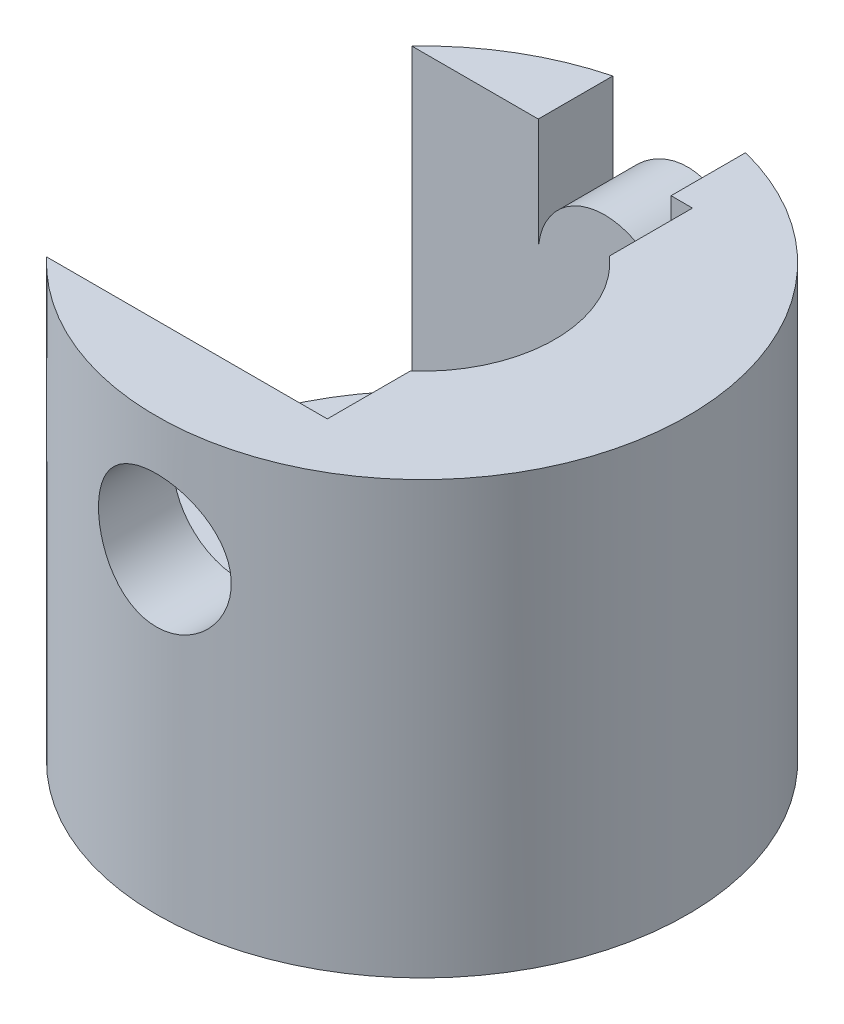
ISO-10303-21;
HEADER;
FILE_DESCRIPTION(('STEP AP214'),'2;1');
FILE_NAME('part.step','',(''),(''),'','','');
FILE_SCHEMA(('AUTOMOTIVE_DESIGN { 1 0 10303 214 1 1 1 1 }'));
ENDSEC;
DATA;
#1=APPLICATION_CONTEXT('core data for automotive mechanical design processes');
#2=APPLICATION_PROTOCOL_DEFINITION('international standard','automotive_design',2000,#1);
#3=PRODUCT_CONTEXT('',#1,'mechanical');
#4=PRODUCT('Part','Part','',(#3));
#5=PRODUCT_RELATED_PRODUCT_CATEGORY('part','',(#4));
#6=PRODUCT_DEFINITION_FORMATION('','',#4);
#7=PRODUCT_DEFINITION_CONTEXT('part definition',#1,'design');
#8=PRODUCT_DEFINITION('design','',#6,#7);
#9=PRODUCT_DEFINITION_SHAPE('','',#8);
#10=(LENGTH_UNIT() NAMED_UNIT(*) SI_UNIT(.MILLI.,.METRE.));
#11=(NAMED_UNIT(*) PLANE_ANGLE_UNIT() SI_UNIT($,.RADIAN.));
#12=(NAMED_UNIT(*) SI_UNIT($,.STERADIAN.) SOLID_ANGLE_UNIT());
#13=UNCERTAINTY_MEASURE_WITH_UNIT(LENGTH_MEASURE(1.E-05),#10,'distance_accuracy_value','');
#14=(GEOMETRIC_REPRESENTATION_CONTEXT(3) GLOBAL_UNCERTAINTY_ASSIGNED_CONTEXT((#13)) GLOBAL_UNIT_ASSIGNED_CONTEXT((#10,
#11,#12)) REPRESENTATION_CONTEXT('',''));
#15=CARTESIAN_POINT('',(0.,0.,0.));
#16=DIRECTION('',(0.,0.,1.));
#17=DIRECTION('',(1.,0.,0.));
#18=AXIS2_PLACEMENT_3D('',#15,#16,#17);
#19=CARTESIAN_POINT('',(0.,130.,0.));
#20=DIRECTION('',(0.,1.,0.));
#21=DIRECTION('',(0.,0.,1.));
#22=AXIS2_PLACEMENT_3D('',#19,#20,#21);
#23=PLANE('',#22);
#24=DIRECTION('',(0.,0.,1.));
#25=VECTOR('',#24,1.);
#26=CARTESIAN_POINT('',(-20.,130.,-55.));
#27=LINE('',#26,#25);
#28=CARTESIAN_POINT('',(-20.,130.,-77.4596669241483));
#29=VERTEX_POINT('',#28);
#30=CARTESIAN_POINT('',(-20.,130.,-55.));
#31=VERTEX_POINT('',#30);
#32=EDGE_CURVE('E122',#29,#31,#27,.T.);
#33=ORIENTED_EDGE('',*,*,#32,.F.);
#34=CARTESIAN_POINT('',(0.,130.,0.));
#35=DIRECTION('',(0.,1.,0.));
#36=DIRECTION('',(0.,0.,1.));
#37=AXIS2_PLACEMENT_3D('',#34,#35,#36);
#38=CIRCLE('',#37,80.);
#39=CARTESIAN_POINT('',(-58.0947501931112,130.,-55.));
#40=VERTEX_POINT('',#39);
#41=EDGE_CURVE('E47',#29,#40,#38,.T.);
#42=ORIENTED_EDGE('',*,*,#41,.T.);
#43=DIRECTION('',(1.,0.,0.));
#44=VECTOR('',#43,1.);
#45=CARTESIAN_POINT('',(-58.0947501931112,130.,-55.));
#46=LINE('',#45,#44);
#47=EDGE_CURVE('E176',#40,#31,#46,.T.);
#48=ORIENTED_EDGE('',*,*,#47,.T.);
#49=EDGE_LOOP('',(#33,#42,#48));
#50=FACE_BOUND('',#49,.T.);
#51=ADVANCED_FACE('F37',(#50),#23,.T.);
#52=CARTESIAN_POINT('',(0.,130.,0.));
#53=DIRECTION('',(0.,-1.,0.));
#54=DIRECTION('',(0.,0.,-1.));
#55=AXIS2_PLACEMENT_3D('',#52,#53,#54);
#56=CYLINDRICAL_SURFACE('',#55,80.);
#57=CARTESIAN_POINT('',(0.,0.,0.));
#58=DIRECTION('',(0.,1.,0.));
#59=DIRECTION('',(0.,0.,1.));
#60=AXIS2_PLACEMENT_3D('',#57,#58,#59);
#61=CIRCLE('',#60,80.);
#62=CARTESIAN_POINT('',(0.,0.,80.));
#63=VERTEX_POINT('',#62);
#64=EDGE_CURVE('E42',#63,#63,#61,.T.);
#65=ORIENTED_EDGE('',*,*,#64,.T.);
#66=EDGE_LOOP('',(#65));
#67=FACE_BOUND('',#66,.T.);
#68=ORIENTED_EDGE('',*,*,#41,.F.);
#69=DIRECTION('',(0.,1.,0.));
#70=VECTOR('',#69,1.);
#71=CARTESIAN_POINT('',(-20.,-0.001000000000001,-77.4596669241483));
#72=LINE('',#71,#70);
#73=CARTESIAN_POINT('',(-20.,95.,-77.4596669241483));
#74=VERTEX_POINT('',#73);
#75=EDGE_CURVE('E136',#74,#29,#72,.T.);
#76=ORIENTED_EDGE('',*,*,#75,.F.);
#77=CARTESIAN_POINT('',(20.,95.,-77.4596669241483));
#78=CARTESIAN_POINT('',(19.9999976493019,94.4477505366287,-77.45966837968));
#79=CARTESIAN_POINT('',(19.9771070159195,93.895454103291,-77.4655889217648));
#80=CARTESIAN_POINT('',(19.8857326315979,92.7948608282561,-77.4890948256312));
#81=CARTESIAN_POINT('',(19.8172436530298,92.2465644524332,-77.5066815248802));
#82=CARTESIAN_POINT('',(19.6352098850017,91.1576861665179,-77.5529970179961));
#83=CARTESIAN_POINT('',(19.5216416633879,90.6171084201946,-77.5817316063507));
#84=CARTESIAN_POINT('',(19.2504012466283,89.5478171732061,-77.6494788140806));
#85=CARTESIAN_POINT('',(19.092730156028,89.0191033757693,-77.6884911760501));
#86=CARTESIAN_POINT('',(18.7347858723762,87.9778573017547,-77.7755851607952));
#87=CARTESIAN_POINT('',(18.5345686633591,87.465304767494,-77.8236548562092));
#88=CARTESIAN_POINT('',(18.0929438772744,86.4590824887917,-77.9275099069875));
#89=CARTESIAN_POINT('',(17.8515360824935,85.9654128441728,-77.983295303133));
#90=CARTESIAN_POINT('',(17.3292908518329,85.0001600244818,-78.1010069709965));
#91=CARTESIAN_POINT('',(17.0484530849071,84.5285770348893,-78.1629332942712));
#92=CARTESIAN_POINT('',(16.4493016741369,83.6104891766527,-78.2912147047638));
#93=CARTESIAN_POINT('',(16.1309874837106,83.1639846739108,-78.3575698565685));
#94=CARTESIAN_POINT('',(15.4523295484327,82.2902579904637,-78.4942523513874));
#95=CARTESIAN_POINT('',(15.0912769316733,81.863594507003,-78.5646323973477));
#96=CARTESIAN_POINT('',(14.3348154256331,81.0420317489979,-78.7061693701151));
#97=CARTESIAN_POINT('',(13.9394061074495,80.6471328711154,-78.7773263066111));
#98=CARTESIAN_POINT('',(13.1167851377778,79.8916635671946,-78.9184647455924));
#99=CARTESIAN_POINT('',(12.6895706108638,79.531096251715,-78.9884461410974));
#100=CARTESIAN_POINT('',(11.8061470932551,78.8467625469031,-79.125309788489));
#101=CARTESIAN_POINT('',(11.3499379747291,78.5229963198368,-79.1921920267098));
#102=CARTESIAN_POINT('',(10.4049316417072,77.9102685280711,-79.3219262417081));
#103=CARTESIAN_POINT('',(9.91576778183844,77.6218573083554,-79.3847087368301));
#104=CARTESIAN_POINT('',(8.91402460740854,77.087366013059,-79.5034246104348));
#105=CARTESIAN_POINT('',(8.4014450082705,76.8412864521181,-79.5593579056472));
#106=CARTESIAN_POINT('',(7.35652241375885,76.3934247180437,-79.6627714076378));
#107=CARTESIAN_POINT('',(6.8241816790675,76.191637495995,-79.7102525777631));
#108=CARTESIAN_POINT('',(5.74352539274417,75.8339930035367,-79.7953985414387));
#109=CARTESIAN_POINT('',(5.19521021241926,75.6781346664991,-79.8330635629518));
#110=CARTESIAN_POINT('',(4.09790170386681,75.4163618174514,-79.8968278076243));
#111=CARTESIAN_POINT('',(3.54914710222575,75.3094995675713,-79.9231458592478));
#112=CARTESIAN_POINT('',(2.44420188812401,75.1420520699423,-79.9645640120267));
#113=CARTESIAN_POINT('',(1.88801136656687,75.081466256993,-79.9796642501915));
#114=CARTESIAN_POINT('',(0.772387784532631,75.0071033456653,-79.9982163345339));
#115=CARTESIAN_POINT('',(0.212955150704412,74.9933202223291,-80.0016696800274));
#116=CARTESIAN_POINT('',(-0.905043535883845,75.0126675549975,-79.9968334806817));
#117=CARTESIAN_POINT('',(-1.46360959931959,75.045797428389,-79.9885440816758));
#118=CARTESIAN_POINT('',(-2.56334384968023,75.1574213028508,-79.9607722552294));
#119=CARTESIAN_POINT('',(-3.10462280142206,75.2348907283915,-79.9415426857385));
#120=CARTESIAN_POINT('',(-4.17855638031179,75.433756625063,-79.892606672297));
#121=CARTESIAN_POINT('',(-4.71121115684745,75.5551523344515,-79.8629004100269));
#122=CARTESIAN_POINT('',(-5.76423944480283,75.8408979363048,-79.793809235484));
#123=CARTESIAN_POINT('',(-6.28461254980903,76.0052492480493,-79.7544240034146));
#124=CARTESIAN_POINT('',(-7.30956043959354,76.3756271479306,-79.6670251831232));
#125=CARTESIAN_POINT('',(-7.81413499970193,76.5816543284263,-79.6190114722615));
#126=CARTESIAN_POINT('',(-8.80864085397679,77.0358863395792,-79.5151562715121));
#127=CARTESIAN_POINT('',(-9.29839908441468,77.2844547353121,-79.4592481022651));
#128=CARTESIAN_POINT('',(-10.2552789976075,77.8206506027931,-79.3414246717065));
#129=CARTESIAN_POINT('',(-10.7224006070109,78.1082782010968,-79.2795093909314));
#130=CARTESIAN_POINT('',(-11.6311098742688,78.7206414852758,-79.1512974913243));
#131=CARTESIAN_POINT('',(-12.0726938117613,79.045382557485,-79.0850002371202));
#132=CARTESIAN_POINT('',(-12.9274947222486,79.7297783994631,-78.9497762308026));
#133=CARTESIAN_POINT('',(-13.3407111650586,80.0894338214734,-78.8808494295807));
#134=CARTESIAN_POINT('',(-14.1469748210318,80.8515342222075,-78.7403015629414));
#135=CARTESIAN_POINT('',(-14.5391724570307,81.2548744010124,-78.6686580917767));
#136=CARTESIAN_POINT('',(-15.2883058227192,82.0932675123287,-78.5265121249807));
#137=CARTESIAN_POINT('',(-15.6452408930943,82.5283210375297,-78.4560096507035));
#138=CARTESIAN_POINT('',(-16.3214268715421,83.4273001593975,-78.3181341115604));
#139=CARTESIAN_POINT('',(-16.6406757432225,83.8912273141982,-78.2507612159222));
#140=CARTESIAN_POINT('',(-17.239202615518,84.8448632993083,-78.1210835720695));
#141=CARTESIAN_POINT('',(-17.5184808015765,85.33457200999,-78.0587788003422));
#142=CARTESIAN_POINT('',(-18.0362602046587,86.3389335232051,-77.9407737441754));
#143=CARTESIAN_POINT('',(-18.2745555859852,86.8536964803494,-77.8851072054245));
#144=CARTESIAN_POINT('',(-18.7068193138944,87.9023568353277,-77.7824164163084));
#145=CARTESIAN_POINT('',(-18.9007873799356,88.4362543542369,-77.7353922206398));
#146=CARTESIAN_POINT('',(-19.2427595818706,89.5192520829459,-77.6514470713696));
#147=CARTESIAN_POINT('',(-19.3907717788096,90.068349608112,-77.6145243460204));
#148=CARTESIAN_POINT('',(-19.6395945432371,91.1777652676668,-77.551936285079));
#149=CARTESIAN_POINT('',(-19.7404063560237,91.7380831056208,-77.5262706524897));
#150=CARTESIAN_POINT('',(-19.8919014124738,92.8507796547977,-77.4875357832161));
#151=CARTESIAN_POINT('',(-19.9438388755152,93.4029769143795,-77.474151616895));
#152=CARTESIAN_POINT('',(-20.001674731883,94.5099335710854,-77.4592403380146));
#153=CARTESIAN_POINT('',(-20.0075739323212,95.0646929231221,-77.4577130175892));
#154=CARTESIAN_POINT('',(-19.973284082299,96.1726398598568,-77.4665620086827));
#155=CARTESIAN_POINT('',(-19.9330989462917,96.7258275740506,-77.4769373091803));
#156=CARTESIAN_POINT('',(-19.8069970278536,97.8266192368147,-77.5092710191194));
#157=CARTESIAN_POINT('',(-19.7210804467414,98.3742232099549,-77.5312293775702));
#158=CARTESIAN_POINT('',(-19.506032407673,99.4509732061142,-77.5856092367837));
#159=CARTESIAN_POINT('',(-19.377632844242,99.980274656623,-77.6178532209274));
#160=CARTESIAN_POINT('',(-19.0783358937308,101.026017563014,-77.691961241754));
#161=CARTESIAN_POINT('',(-18.9074390990744,101.542459198056,-77.7338251443318));
#162=CARTESIAN_POINT('',(-18.5244464116937,102.559099124078,-77.8259831195735));
#163=CARTESIAN_POINT('',(-18.31234684904,103.059295963499,-77.8762779431245));
#164=CARTESIAN_POINT('',(-17.8485161428307,104.040177352478,-77.9838901168577));
#165=CARTESIAN_POINT('',(-17.596784199686,104.520861508119,-78.041207608718));
#166=CARTESIAN_POINT('',(-17.050140557841,105.468903813968,-78.1624755524835));
#167=CARTESIAN_POINT('',(-16.7544788355005,105.935815722887,-78.2265340447418));
#168=CARTESIAN_POINT('',(-16.1258425389138,106.843219952829,-78.3585369751919));
#169=CARTESIAN_POINT('',(-15.7928675666899,107.283711991984,-78.4264814548272));
#170=CARTESIAN_POINT('',(-15.0917774222407,108.135546532086,-78.5644058735959));
#171=CARTESIAN_POINT('',(-14.7236572252104,108.546884850157,-78.6343861027884));
#172=CARTESIAN_POINT('',(-13.9547000125146,109.337731448901,-78.774482218363));
#173=CARTESIAN_POINT('',(-13.5538625368302,109.717239281873,-78.8445981066391));
#174=CARTESIAN_POINT('',(-12.7115903273172,110.451058251851,-78.9848227719709));
#175=CARTESIAN_POINT('',(-12.2693900151829,110.804499760193,-79.0548873483663));
#176=CARTESIAN_POINT('',(-11.3562317557386,111.472891645209,-79.1912184360659));
#177=CARTESIAN_POINT('',(-10.885273274809,111.787841307324,-79.2574848768499));
#178=CARTESIAN_POINT('',(-9.9177839385446,112.376947739056,-79.3843532707781));
#179=CARTESIAN_POINT('',(-9.42125387584849,112.651105772061,-79.4449553993345));
#180=CARTESIAN_POINT('',(-8.40601947649277,113.15655157691,-79.5587814272681));
#181=CARTESIAN_POINT('',(-7.88731546792381,113.387839982792,-79.6120054357643));
#182=CARTESIAN_POINT('',(-6.83524933911152,113.804176671815,-79.7091987430276));
#183=CARTESIAN_POINT('',(-6.30202229774122,113.989551016729,-79.7532329298633));
#184=CARTESIAN_POINT('',(-5.22112203239086,114.31471956433,-79.8312811833417));
#185=CARTESIAN_POINT('',(-4.67344883812773,114.454513860771,-79.8652952705948));
#186=CARTESIAN_POINT('',(-3.56776949188514,114.687309301311,-79.9223210224658));
#187=CARTESIAN_POINT('',(-3.00976501703529,114.780317972492,-79.9453344568885));
#188=CARTESIAN_POINT('',(-1.88753231503774,114.918756057542,-79.9796994772742));
#189=CARTESIAN_POINT('',(-1.32330422461221,114.964186514528,-79.9910513189087));
#190=CARTESIAN_POINT('',(-0.208225808915083,115.006485847005,-80.0016192868872));
#191=CARTESIAN_POINT('',(0.342573298231126,115.00463571553,-80.0011555390562));
#192=CARTESIAN_POINT('',(1.44200943374339,114.955535260996,-79.9888918528778));
#193=CARTESIAN_POINT('',(1.9906465035497,114.908285812408,-79.9770921328811));
#194=CARTESIAN_POINT('',(3.08179336996437,114.768790109732,-79.9424825094208));
#195=CARTESIAN_POINT('',(3.62430337979254,114.676545426431,-79.9196729903105));
#196=CARTESIAN_POINT('',(4.69936887164887,114.447826520613,-79.8636693212432));
#197=CARTESIAN_POINT('',(5.23192430907164,114.311352099956,-79.8304751247652));
#198=CARTESIAN_POINT('',(6.28052796768513,113.996133477857,-79.7548106955068));
#199=CARTESIAN_POINT('',(6.79664995828471,113.817622163078,-79.7123916644837));
#200=CARTESIAN_POINT('',(7.81192754964574,113.419314649645,-79.619304689993));
#201=CARTESIAN_POINT('',(8.31108326347316,113.199518726183,-79.5686368015101));
#202=CARTESIAN_POINT('',(9.28923103353537,112.720238186338,-79.4603823645421));
#203=CARTESIAN_POINT('',(9.76822116063031,112.460749783729,-79.4027951561423));
#204=CARTESIAN_POINT('',(10.7029568700637,111.903924957003,-79.2822100272022));
#205=CARTESIAN_POINT('',(11.1587019902907,111.606587780862,-79.2192119991613));
#206=CARTESIAN_POINT('',(12.0547258916069,110.968509075814,-79.0878847524053));
#207=CARTESIAN_POINT('',(12.4943723559947,110.626898189759,-79.0194639576567));
#208=CARTESIAN_POINT('',(13.3434844344005,109.908411805057,-78.8805207050474));
#209=CARTESIAN_POINT('',(13.7529495439741,109.531535717234,-78.8099982120872));
#210=CARTESIAN_POINT('',(14.5391474997276,108.74490756844,-78.6687535130242));
#211=CARTESIAN_POINT('',(14.915872313816,108.335147487281,-78.5980312622845));
#212=CARTESIAN_POINT('',(15.634002794518,107.485486332693,-78.4583443831096));
#213=CARTESIAN_POINT('',(15.975408450149,107.045585249892,-78.389379755221));
#214=CARTESIAN_POINT('',(16.6266285422317,106.129990073696,-78.253868498207));
#215=CARTESIAN_POINT('',(16.9357336359601,105.653780828662,-78.1873911118747));
#216=CARTESIAN_POINT('',(17.5126576837246,104.676205287554,-78.0601955430651));
#217=CARTESIAN_POINT('',(17.7804746699988,104.174837793966,-77.9994776351337));
#218=CARTESIAN_POINT('',(18.2725948716073,103.150755319888,-77.8856601317807));
#219=CARTESIAN_POINT('',(18.4969262265036,102.628054411175,-77.8325556155651));
#220=CARTESIAN_POINT('',(18.9004633820715,101.564734268076,-77.735549246793));
#221=CARTESIAN_POINT('',(19.0796760623687,101.024117779675,-77.6916459914138));
#222=CARTESIAN_POINT('',(19.3619707467141,100.032616036064,-77.6217170916352));
#223=CARTESIAN_POINT('',(19.4730420315856,99.584113751948,-77.5938805058715));
#224=CARTESIAN_POINT('',(19.663958698367,98.6799756629647,-77.5457184812528));
#225=CARTESIAN_POINT('',(19.7437964187594,98.2243381363107,-77.5253948853833));
#226=CARTESIAN_POINT('',(19.8717193776867,97.3083744156483,-77.4927037623413));
#227=CARTESIAN_POINT('',(19.9198067892231,96.8480485447019,-77.4803356906916));
#228=CARTESIAN_POINT('',(19.9839439088543,95.9251590250346,-77.4638177332034));
#229=CARTESIAN_POINT('',(20.0000019690803,95.4625959912337,-77.4596657049111));
#230=CARTESIAN_POINT('',(20.,95.,-77.4596669241483));
#231=B_SPLINE_CURVE_WITH_KNOTS('',3,(#77,#78,#79,#80,#81,#82,#83,#84,#85,#86,#87,#88,#89,#90,
#91,#92,#93,#94,#95,#96,#97,#98,#99,#100,#101,#102,#103,#104,#105,#106,#107,#108,#109,#110,#111,
#112,#113,#114,#115,#116,#117,#118,#119,#120,#121,#122,#123,#124,#125,#126,#127,#128,#129,#130,
#131,#132,#133,#134,#135,#136,#137,#138,#139,#140,#141,#142,#143,#144,#145,#146,#147,#148,#149,
#150,#151,#152,#153,#154,#155,#156,#157,#158,#159,#160,#161,#162,#163,#164,#165,#166,#167,#168,
#169,#170,#171,#172,#173,#174,#175,#176,#177,#178,#179,#180,#181,#182,#183,#184,#185,#186,#187,
#188,#189,#190,#191,#192,#193,#194,#195,#196,#197,#198,#199,#200,#201,#202,#203,#204,#205,#206,
#207,#208,#209,#210,#211,#212,#213,#214,#215,#216,#217,#218,#219,#220,#221,#222,#223,#224,#225,
#226,#227,#228,#229,#230),.UNSPECIFIED.,.T.,.F.,(4,2,2,2,2,2,2,2,2,2,2,2,2,2,2,2,2,2,2,2,2,2,2,
2,2,2,2,2,2,2,2,2,2,2,2,2,2,2,2,2,2,2,2,2,2,2,2,2,2,2,2,2,2,2,2,2,2,2,2,2,2,2,2,2,2,2,2,2,2,2,2,
2,2,2,2,2,4),(0.,1.65632565075379,3.31284122390797,4.97021898245634,6.62755523610075,
8.28272405107371,9.93790161473371,11.5930930757675,13.2483086802409,14.9363807765496,
16.6244739494697,18.3127199242449,20.0009733426711,21.7128477433761,23.4247429544272,
25.1364429238655,26.8481031385591,28.5250909718271,30.2020583227634,31.8788097878022,
33.5555404294267,35.1950059734611,36.8344430882628,38.4739343779278,40.113448972096,
41.7677470910819,43.422050570278,45.0765944466321,46.7311692377786,48.430564374821,
50.1299912799474,51.8295099724496,53.5290207798018,55.236832749169,56.944655526746,
58.652178568412,60.3596565575824,62.0220157033976,63.6843457057922,65.3465345185485,
67.0087160140934,68.6436354791722,70.2785321542713,71.9135745163924,73.5486498699601,
75.2157926192829,76.8829531518001,78.5503524006036,80.2177750977823,81.9269783989499,
83.6362134247319,85.3453955014516,87.0545522974806,88.751198980581,90.4478421738118,
92.1442123161098,93.8405452659871,95.4909687201875,97.1413603849702,98.7916944385566,
100.442035885342,102.083440957036,103.724835088,105.366385887691,107.007969308756,
108.688889835239,110.369838449879,112.051198289983,113.732558652915,115.445330157796,
117.158183266933,118.869924261035,120.581404093229,121.9689547397,123.356845535881,
124.744641334518,126.132075197357),.UNSPECIFIED.);
#232=CARTESIAN_POINT('',(20.,95.,-77.4596669241483));
#233=VERTEX_POINT('',#232);
#234=EDGE_CURVE('E135',#74,#233,#231,.T.);
#235=ORIENTED_EDGE('',*,*,#234,.T.);
#236=DIRECTION('',(0.,1.,0.));
#237=VECTOR('',#236,1.);
#238=CARTESIAN_POINT('',(20.,-0.001000000000001,-77.4596669241483));
#239=LINE('',#238,#237);
#240=CARTESIAN_POINT('',(20.,130.,-77.4596669241483));
#241=VERTEX_POINT('',#240);
#242=EDGE_CURVE('E54',#233,#241,#239,.T.);
#243=ORIENTED_EDGE('',*,*,#242,.T.);
#244=CARTESIAN_POINT('',(-58.0947501931112,130.,55.));
#245=VERTEX_POINT('',#244);
#246=EDGE_CURVE('E11',#245,#241,#38,.T.);
#247=ORIENTED_EDGE('',*,*,#246,.F.);
#248=DIRECTION('',(0.,-1.,0.));
#249=VECTOR('',#248,1.);
#250=CARTESIAN_POINT('',(-58.0947501931112,130.,55.));
#251=LINE('',#250,#249);
#252=CARTESIAN_POINT('',(-58.0947501931112,40.,55.));
#253=VERTEX_POINT('',#252);
#254=EDGE_CURVE('E204',#245,#253,#251,.T.);
#255=ORIENTED_EDGE('',*,*,#254,.T.);
#256=CARTESIAN_POINT('',(0.,40.,0.));
#257=DIRECTION('',(0.,-1.,0.));
#258=DIRECTION('',(0.,0.,1.));
#259=AXIS2_PLACEMENT_3D('',#256,#257,#258);
#260=CIRCLE('',#259,80.);
#261=CARTESIAN_POINT('',(-58.0947501931112,40.,-55.));
#262=VERTEX_POINT('',#261);
#263=EDGE_CURVE('E173',#253,#262,#260,.T.);
#264=ORIENTED_EDGE('',*,*,#263,.T.);
#265=DIRECTION('',(0.,-1.,0.));
#266=VECTOR('',#265,1.);
#267=CARTESIAN_POINT('',(-58.0947501931112,130.,-55.));
#268=LINE('',#267,#266);
#269=EDGE_CURVE('E191',#40,#262,#268,.T.);
#270=ORIENTED_EDGE('',*,*,#269,.F.);
#271=EDGE_LOOP('',(#68,#76,#235,#243,#247,#255,#264,#270));
#272=FACE_BOUND('',#271,.T.);
#273=CARTESIAN_POINT('',(0.,75.,80.));
#274=CARTESIAN_POINT('',(0.552553374862314,75.0000023314968,79.9999986950356));
#275=CARTESIAN_POINT('',(1.10515356950526,75.0229179658283,79.9942610849838));
#276=CARTESIAN_POINT('',(2.20636296648807,75.114394489958,79.9714660513514));
#277=CARTESIAN_POINT('',(2.75497170625673,75.1829605876346,79.9544073362416));
#278=CARTESIAN_POINT('',(3.84448035075908,75.3652050745676,79.9094323300751));
#279=CARTESIAN_POINT('',(4.38537620054034,75.4789063483961,79.8815105313286));
#280=CARTESIAN_POINT('',(5.45531134581282,75.7504750259673,79.8155804522386));
#281=CARTESIAN_POINT('',(5.98435094400592,75.908341300743,79.7775724297252));
#282=CARTESIAN_POINT('',(7.02629056749776,76.266756744417,79.692560221474));
#283=CARTESIAN_POINT('',(7.53920942950872,76.467253797031,79.6455670271467));
#284=CARTESIAN_POINT('',(8.54613454441612,76.9095061873634,79.5438224095931));
#285=CARTESIAN_POINT('',(9.04014069713948,77.1512617435747,79.4890709452816));
#286=CARTESIAN_POINT('',(10.006009638304,77.6742566340583,79.3732724764846));
#287=CARTESIAN_POINT('',(10.4778724123847,77.9554959939362,79.3122254679164));
#288=CARTESIAN_POINT('',(11.3964465566084,78.5554883495366,79.1854532836813));
#289=CARTESIAN_POINT('',(11.8431575789993,78.8742418637475,79.1197280433608));
#290=CARTESIAN_POINT('',(12.7166269502415,79.5533479268748,78.9840892744047));
#291=CARTESIAN_POINT('',(13.1428634930067,79.914360796854,78.9141207667824));
#292=CARTESIAN_POINT('',(13.9635663670633,80.6706522026163,78.7730425035487));
#293=CARTESIAN_POINT('',(14.358032322819,81.0659311433175,78.7019327344592));
#294=CARTESIAN_POINT('',(15.1126515394363,81.8882042431445,78.5605192145215));
#295=CARTESIAN_POINT('',(15.4728010871473,82.3152018254582,78.490215551619));
#296=CARTESIAN_POINT('',(16.1563281947099,83.1981042190157,78.3523749041428));
#297=CARTESIAN_POINT('',(16.4797055460334,83.654009194165,78.2848379352598));
#298=CARTESIAN_POINT('',(17.0919754850718,84.5987541640258,78.1534638181262));
#299=CARTESIAN_POINT('',(17.3802827011821,85.0879835678767,78.0896967594462));
#300=CARTESIAN_POINT('',(17.9145598711437,86.0898463182741,77.9688630436013));
#301=CARTESIAN_POINT('',(18.1605292905372,86.6024799601642,77.9117964710237));
#302=CARTESIAN_POINT('',(18.6081694440892,87.6475107265207,77.806098433039));
#303=CARTESIAN_POINT('',(18.8098456887771,88.1799053828671,77.7574659185063));
#304=CARTESIAN_POINT('',(19.167269734681,89.2606876202089,77.6701336387272));
#305=CARTESIAN_POINT('',(19.3230186360386,89.8090748177737,77.6314336355609));
#306=CARTESIAN_POINT('',(19.5846005492968,90.9066751128424,77.5658510578936));
#307=CARTESIAN_POINT('',(19.6913708451233,91.4556516774823,77.5387473172898));
#308=CARTESIAN_POINT('',(19.8586008155615,92.5610597920003,77.4960866447944));
#309=CARTESIAN_POINT('',(19.9190610516028,93.1174912514175,77.4805295729194));
#310=CARTESIAN_POINT('',(19.9931329860711,94.233590647834,77.4614491387815));
#311=CARTESIAN_POINT('',(20.0067513360911,94.7932581140105,77.4579240679634));
#312=CARTESIAN_POINT('',(19.9870360082187,95.9117056144315,77.4630137483269));
#313=CARTESIAN_POINT('',(19.9537029831812,96.4704856609073,77.4716283307076));
#314=CARTESIAN_POINT('',(19.841761814828,97.569460466295,77.5003723188602));
#315=CARTESIAN_POINT('',(19.7642724534682,98.1097770919092,77.5202171040157));
#316=CARTESIAN_POINT('',(19.5655280775596,99.1817789964538,77.570616893999));
#317=CARTESIAN_POINT('',(19.4442738771995,99.7134644357641,77.6011716995804));
#318=CARTESIAN_POINT('',(19.1589731789207,100.764575301028,77.6721013280764));
#319=CARTESIAN_POINT('',(18.994924592257,101.284000127205,77.7124766303118));
#320=CARTESIAN_POINT('',(18.6253121998604,102.307091944643,77.8018885701763));
#321=CARTESIAN_POINT('',(18.4197477402838,102.810758687582,77.8509253442155));
#322=CARTESIAN_POINT('',(17.9663570726194,103.804036121401,77.9568131713948));
#323=CARTESIAN_POINT('',(17.718125928368,104.293454063028,78.0137379785739));
#324=CARTESIAN_POINT('',(17.1826589445638,105.249708814394,78.133420866079));
#325=CARTESIAN_POINT('',(16.8954229609801,105.71654554074,78.1961789679449));
#326=CARTESIAN_POINT('',(16.2838786113378,106.624760311453,78.3258129296076));
#327=CARTESIAN_POINT('',(15.9595648266115,107.066134620445,78.3926893906138));
#328=CARTESIAN_POINT('',(15.2760389627995,107.92060297996,78.5287465444139));
#329=CARTESIAN_POINT('',(14.9168262158307,108.333696488999,78.5979272812894));
#330=CARTESIAN_POINT('',(14.1550737678961,109.140379914247,78.738733251184));
#331=CARTESIAN_POINT('',(13.7515900632081,109.533076639801,78.8103718974193));
#332=CARTESIAN_POINT('',(12.9128067481253,110.283193125012,78.9521393106884));
#333=CARTESIAN_POINT('',(12.4775065163574,110.640612195381,79.0222680481992));
#334=CARTESIAN_POINT('',(11.5779456993448,111.317723473108,79.1590684580988));
#335=CARTESIAN_POINT('',(11.113683981535,111.63741420365,79.2257399951037));
#336=CARTESIAN_POINT('',(10.1593031083248,112.236765052455,79.3537669415628));
#337=CARTESIAN_POINT('',(9.66918411063258,112.516425414831,79.4151223834348));
#338=CARTESIAN_POINT('',(8.66465976090819,113.034526367728,79.5310011038941));
#339=CARTESIAN_POINT('',(8.15017608224034,113.272820652387,79.5854999519251));
#340=CARTESIAN_POINT('',(7.10209907529817,113.705120103132,79.685866283564));
#341=CARTESIAN_POINT('',(6.56850563968339,113.899125020399,79.7317337186796));
#342=CARTESIAN_POINT('',(5.48613684717225,114.241215755903,79.8135125120124));
#343=CARTESIAN_POINT('',(4.93736386767441,114.389308720946,79.8494254196919));
#344=CARTESIAN_POINT('',(3.82862493749695,114.638340968327,79.9102611106421));
#345=CARTESIAN_POINT('',(3.26865926312345,114.739281413191,79.9351841648622));
#346=CARTESIAN_POINT('',(2.15620947798921,114.89114894507,79.9728237841376));
#347=CARTESIAN_POINT('',(1.6039008987919,114.943290392048,79.9858365432587));
#348=CARTESIAN_POINT('',(0.496713964469053,115.001514241305,80.0003735412268));
#349=CARTESIAN_POINT('',(-0.0581643466547616,115.007597429346,80.0018979760668));
#350=CARTESIAN_POINT('',(-1.16637153729242,114.973654575439,79.9934160549155));
#351=CARTESIAN_POINT('',(-1.71970054145991,114.933632356509,79.9834106549674));
#352=CARTESIAN_POINT('',(-2.82080714740937,114.807829492892,79.9521507125016));
#353=CARTESIAN_POINT('',(-3.36858477088819,114.722049027115,79.9308962139667));
#354=CARTESIAN_POINT('',(-4.44655600282126,114.507068243944,79.8781261803535));
#355=CARTESIAN_POINT('',(-4.97688994266787,114.378531840119,79.8467677590568));
#356=CARTESIAN_POINT('',(-6.0246819666538,114.078787561056,79.7745510411713));
#357=CARTESIAN_POINT('',(-6.5421402169409,113.907580236758,79.7336928672376));
#358=CARTESIAN_POINT('',(-7.56075993095561,113.523799746173,79.6435583563946));
#359=CARTESIAN_POINT('',(-8.06192019042454,113.311223531208,79.594281399096));
#360=CARTESIAN_POINT('',(-9.0446492667819,112.846283039438,79.488606685726));
#361=CARTESIAN_POINT('',(-9.52621772176592,112.593918028065,79.4322087981941));
#362=CARTESIAN_POINT('',(-10.4750517301961,112.046366511104,79.3127101495236));
#363=CARTESIAN_POINT('',(-10.9419120576077,111.750499838884,79.2495082373428));
#364=CARTESIAN_POINT('',(-11.8491713422069,111.121471770117,79.1189435371977));
#365=CARTESIAN_POINT('',(-12.2895700424967,110.788310011588,79.0515807088509));
#366=CARTESIAN_POINT('',(-13.1411743549394,110.086878075293,78.9144828604604));
#367=CARTESIAN_POINT('',(-13.5523755645437,109.718602622434,78.8447474850069));
#368=CARTESIAN_POINT('',(-14.3429051286227,108.949381524516,78.7047790615734));
#369=CARTESIAN_POINT('',(-14.7222330212665,108.54843540624,78.6345460063983));
#370=CARTESIAN_POINT('',(-15.4554827101946,107.706195733532,78.4937632096491));
#371=CARTESIAN_POINT('',(-15.8085508811845,107.264152698877,78.4232481144074));
#372=CARTESIAN_POINT('',(-16.4762179413208,106.3513867207,78.2856977121869));
#373=CARTESIAN_POINT('',(-16.7908161284427,105.880663254034,78.2186624687235));
#374=CARTESIAN_POINT('',(-17.3792647928895,104.913700641748,78.0900243334746));
#375=CARTESIAN_POINT('',(-17.6531162246028,104.41746209412,78.028421314467));
#376=CARTESIAN_POINT('',(-18.1580075024502,103.40284703356,77.9124758787017));
#377=CARTESIAN_POINT('',(-18.38904794416,102.884470828726,77.8581333609407));
#378=CARTESIAN_POINT('',(-18.8052327904798,101.832373000456,77.7586571272349));
#379=CARTESIAN_POINT('',(-18.9906442492249,101.298762108759,77.7134701157289));
#380=CARTESIAN_POINT('',(-19.3158302466352,100.217053611288,77.6332839916808));
#381=CARTESIAN_POINT('',(-19.45560484926,99.6689560258191,77.5982848648605));
#382=CARTESIAN_POINT('',(-19.6882921199968,98.5624065632102,77.5395742477722));
#383=CARTESIAN_POINT('',(-19.7812133869948,98.0039566055372,77.5158606863349));
#384=CARTESIAN_POINT('',(-19.9194035268512,96.8808173565845,77.4804651303761));
#385=CARTESIAN_POINT('',(-19.9646735461771,96.3161282157472,77.4687828463876));
#386=CARTESIAN_POINT('',(-20.006544440919,95.2011049015523,77.4579796397084));
#387=CARTESIAN_POINT('',(-20.0045072413989,94.6508248153061,77.458507206743));
#388=CARTESIAN_POINT('',(-19.955119444869,93.5524461860496,77.471245375213));
#389=CARTESIAN_POINT('',(-19.9077697647612,93.0043475991218,77.4834557402459));
#390=CARTESIAN_POINT('',(-19.7681649668449,91.9142940024709,77.5191900538641));
#391=CARTESIAN_POINT('',(-19.6759110430741,91.3723388297819,77.5427137016204));
#392=CARTESIAN_POINT('',(-19.447271019217,90.2983979782611,77.6003706603106));
#393=CARTESIAN_POINT('',(-19.3108846978968,89.7664123494204,77.6345040244305));
#394=CARTESIAN_POINT('',(-18.9960334265046,88.7192472678552,77.7121406936939));
#395=CARTESIAN_POINT('',(-18.8178253218216,88.203986257501,77.7555866703632));
#396=CARTESIAN_POINT('',(-18.4202695685337,87.1903884927253,77.8507251840838));
#397=CARTESIAN_POINT('',(-18.2009222146742,86.6920516170796,77.9024176620519));
#398=CARTESIAN_POINT('',(-17.7226695392884,85.7154626148664,78.0126090527825));
#399=CARTESIAN_POINT('',(-17.4637600006768,85.237212636375,78.0711086909877));
#400=CARTESIAN_POINT('',(-16.9082059346409,84.3038539177666,78.193308108687));
#401=CARTESIAN_POINT('',(-16.6115606027014,83.8487456713136,78.2570079990384));
#402=CARTESIAN_POINT('',(-15.9743007405763,82.9529388612967,78.3896061005777));
#403=CARTESIAN_POINT('',(-15.6327408347731,82.5129262235746,78.4585965855524));
#404=CARTESIAN_POINT('',(-14.9142797308121,81.6630629615619,78.5983342852843));
#405=CARTESIAN_POINT('',(-14.5373779019106,81.2532128758123,78.6690815313776));
#406=CARTESIAN_POINT('',(-13.7506188212402,80.4662418429339,78.8104067881818));
#407=CARTESIAN_POINT('',(-13.3407540056256,80.0891284492414,78.8809847562011));
#408=CARTESIAN_POINT('',(-12.4907989855636,79.3702286291797,79.0200312951997));
#409=CARTESIAN_POINT('',(-12.0507088047698,79.028442175165,79.0884998678296));
#410=CARTESIAN_POINT('',(-11.1349030086763,78.3766578188532,79.2226730549652));
#411=CARTESIAN_POINT('',(-10.6586860162887,78.0673489112356,79.2883050150152));
#412=CARTESIAN_POINT('',(-9.68106108690308,77.490022156323,79.4136001020149));
#413=CARTESIAN_POINT('',(-9.17965196552503,77.2220062527862,79.4732629479382));
#414=CARTESIAN_POINT('',(-8.155466391719,76.7295031872036,79.5848826204736));
#415=CARTESIAN_POINT('',(-7.63270381995562,76.5049882761588,79.6368443545681));
#416=CARTESIAN_POINT('',(-6.56926271850192,76.1011065189917,79.731609696067));
#417=CARTESIAN_POINT('',(-6.02858690542375,75.9217328621696,79.7744146848517));
#418=CARTESIAN_POINT('',(-5.03666361143149,75.6390718623269,79.8425357898301));
#419=CARTESIAN_POINT('',(-4.58778986372652,75.5278143594063,79.8696278303882));
#420=CARTESIAN_POINT('',(-3.68291121451755,75.3365815994079,79.9164651303395));
#421=CARTESIAN_POINT('',(-3.22690458602132,75.2566140440076,79.9362085808996));
#422=CARTESIAN_POINT('',(-2.31020380099551,75.1284843315885,79.9679515610947));
#423=CARTESIAN_POINT('',(-1.84950992661674,75.080320271512,79.9799515540818));
#424=CARTESIAN_POINT('',(-0.92588791496725,75.0160813090455,79.9959752812035));
#425=CARTESIAN_POINT('',(-0.46296039130568,74.9999980465404,80.0000010933727));
#426=CARTESIAN_POINT('',(0.,75.,80.));
#427=B_SPLINE_CURVE_WITH_KNOTS('',3,(#273,#274,#275,#276,#277,#278,#279,#280,#281,#282,#283,
#284,#285,#286,#287,#288,#289,#290,#291,#292,#293,#294,#295,#296,#297,#298,#299,#300,#301,#302,
#303,#304,#305,#306,#307,#308,#309,#310,#311,#312,#313,#314,#315,#316,#317,#318,#319,#320,#321,
#322,#323,#324,#325,#326,#327,#328,#329,#330,#331,#332,#333,#334,#335,#336,#337,#338,#339,#340,
#341,#342,#343,#344,#345,#346,#347,#348,#349,#350,#351,#352,#353,#354,#355,#356,#357,#358,#359,
#360,#361,#362,#363,#364,#365,#366,#367,#368,#369,#370,#371,#372,#373,#374,#375,#376,#377,#378,
#379,#380,#381,#382,#383,#384,#385,#386,#387,#388,#389,#390,#391,#392,#393,#394,#395,#396,#397,
#398,#399,#400,#401,#402,#403,#404,#405,#406,#407,#408,#409,#410,#411,#412,#413,#414,#415,#416,
#417,#418,#419,#420,#421,#422,#423,#424,#425,#426),.UNSPECIFIED.,.T.,.F.,(4,2,2,2,2,2,2,2,2,2,2,
2,2,2,2,2,2,2,2,2,2,2,2,2,2,2,2,2,2,2,2,2,2,2,2,2,2,2,2,2,2,2,2,2,2,2,2,2,2,2,2,2,2,2,2,2,2,2,2,
2,2,2,2,2,2,2,2,2,2,2,2,2,2,2,2,2,4),(0.,1.65723817869204,3.31466545018767,4.97293415096986,
6.63116046616207,8.28737113071009,9.94359056633385,11.5998110760318,13.2560544792708,
14.9429290677131,16.6298235924749,18.3169004381034,20.0039868503423,21.7162015053368,
23.4284377731552,25.140460900239,26.8524430142596,28.5301358802136,30.2078084067084,
31.8852426922491,33.5626536534379,35.1993423829553,36.8360006655506,38.4727388465232,
40.1095028068959,41.7627578080672,43.4160189142798,45.0695219429279,46.7230566219311,
48.4237862663162,50.1245491346315,51.8253785545566,53.5261976020106,55.2329147830727,
56.9396415523538,58.6461025133584,60.3525214000708,62.0152494819115,63.6779491972275,
65.3405110529386,67.0030664082381,68.6409251399298,70.2787627257362,71.9167210576679,
73.5547096326252,75.2217529577128,76.8888124643709,78.5561228074143,80.2234573049176,
81.9317734645157,83.6401207938877,85.3484281032951,87.0567116453768,88.7547456696824,
90.4527773141947,92.1504972092898,93.8481762570765,95.4970431377094,97.1458766540835,
98.7946663291286,100.443464269615,102.08238965039,103.7213032894,105.360391748542,
106.999515158391,108.681411478586,110.363337821119,112.045651213817,113.727963289989,
115.440788023769,117.153693359591,118.86550242078,120.577053057239,121.965684226167,
123.354656976747,124.74354660644,126.132074250281),.UNSPECIFIED.);
#428=CARTESIAN_POINT('',(0.,75.,80.));
#429=VERTEX_POINT('',#428);
#430=EDGE_CURVE('E166',#429,#429,#427,.T.);
#431=ORIENTED_EDGE('',*,*,#430,.F.);
#432=EDGE_LOOP('',(#431));
#433=FACE_BOUND('',#432,.T.);
#434=ADVANCED_FACE('F39',(#67,#272,#433),#56,.T.);
#435=DIRECTION('',(0.,0.,-1.));
#436=VECTOR('',#435,1.);
#437=CARTESIAN_POINT('',(20.,130.,-77.4596669241483));
#438=LINE('',#437,#436);
#439=CARTESIAN_POINT('',(20.,130.,-55.));
#440=VERTEX_POINT('',#439);
#441=EDGE_CURVE('E142',#440,#241,#438,.T.);
#442=ORIENTED_EDGE('',*,*,#441,.F.);
#443=CARTESIAN_POINT('',(26.4575131106459,130.,-55.));
#444=VERTEX_POINT('',#443);
#445=EDGE_CURVE('E179',#440,#444,#46,.T.);
#446=ORIENTED_EDGE('',*,*,#445,.T.);
#447=DIRECTION('',(0.,0.,1.));
#448=VECTOR('',#447,1.);
#449=CARTESIAN_POINT('',(26.4575131106459,130.,-55.));
#450=LINE('',#449,#448);
#451=CARTESIAN_POINT('',(26.4575131106459,130.,-30.));
#452=VERTEX_POINT('',#451);
#453=EDGE_CURVE('E178',#444,#452,#450,.T.);
#454=ORIENTED_EDGE('',*,*,#453,.T.);
#455=CARTESIAN_POINT('',(0.,130.,0.));
#456=DIRECTION('',(0.,-1.,0.));
#457=DIRECTION('',(0.,0.,-1.));
#458=AXIS2_PLACEMENT_3D('',#455,#456,#457);
#459=CIRCLE('',#458,40.);
#460=CARTESIAN_POINT('',(26.4575131106459,130.,30.));
#461=VERTEX_POINT('',#460);
#462=EDGE_CURVE('E182',#452,#461,#459,.T.);
#463=ORIENTED_EDGE('',*,*,#462,.T.);
#464=DIRECTION('',(0.,0.,1.));
#465=VECTOR('',#464,1.);
#466=CARTESIAN_POINT('',(26.4575131106459,130.,55.));
#467=LINE('',#466,#465);
#468=CARTESIAN_POINT('',(26.4575131106459,130.,55.));
#469=VERTEX_POINT('',#468);
#470=EDGE_CURVE('E185',#461,#469,#467,.T.);
#471=ORIENTED_EDGE('',*,*,#470,.T.);
#472=DIRECTION('',(-1.,0.,0.));
#473=VECTOR('',#472,1.);
#474=CARTESIAN_POINT('',(-58.0947501931112,130.,55.));
#475=LINE('',#474,#473);
#476=EDGE_CURVE('E188',#469,#245,#475,.T.);
#477=ORIENTED_EDGE('',*,*,#476,.T.);
#478=ORIENTED_EDGE('',*,*,#246,.T.);
#479=EDGE_LOOP('',(#442,#446,#454,#463,#471,#477,#478));
#480=FACE_BOUND('',#479,.T.);
#481=ADVANCED_FACE('F250',(#480),#23,.T.);
#482=CARTESIAN_POINT('',(0.,0.,0.));
#483=DIRECTION('',(0.,1.,0.));
#484=DIRECTION('',(0.,0.,1.));
#485=AXIS2_PLACEMENT_3D('',#482,#483,#484);
#486=PLANE('',#485);
#487=CARTESIAN_POINT('',(0.,0.,0.));
#488=DIRECTION('',(0.,-1.,0.));
#489=DIRECTION('',(0.,0.,-1.));
#490=AXIS2_PLACEMENT_3D('',#487,#488,#489);
#491=CIRCLE('',#490,40.);
#492=CARTESIAN_POINT('',(0.,0.,-40.));
#493=VERTEX_POINT('',#492);
#494=EDGE_CURVE('E219',#493,#493,#491,.T.);
#495=ORIENTED_EDGE('',*,*,#494,.F.);
#496=EDGE_LOOP('',(#495));
#497=FACE_BOUND('',#496,.T.);
#498=ORIENTED_EDGE('',*,*,#64,.F.);
#499=EDGE_LOOP('',(#498));
#500=FACE_BOUND('',#499,.T.);
#501=ADVANCED_FACE('F272',(#497,#500),#486,.F.);
#502=CARTESIAN_POINT('',(0.,40.,0.));
#503=DIRECTION('',(0.,-1.,0.));
#504=DIRECTION('',(0.,0.,-1.));
#505=AXIS2_PLACEMENT_3D('',#502,#503,#504);
#506=CYLINDRICAL_SURFACE('',#505,40.);
#507=CARTESIAN_POINT('',(0.,40.,0.));
#508=DIRECTION('',(0.,-1.,0.));
#509=DIRECTION('',(0.,0.,-1.));
#510=AXIS2_PLACEMENT_3D('',#507,#508,#509);
#511=CIRCLE('',#510,40.);
#512=CARTESIAN_POINT('',(26.4575131106459,40.,30.));
#513=VERTEX_POINT('',#512);
#514=CARTESIAN_POINT('',(26.4575131106459,40.,-30.));
#515=VERTEX_POINT('',#514);
#516=EDGE_CURVE('E207',#513,#515,#511,.T.);
#517=ORIENTED_EDGE('',*,*,#516,.F.);
#518=DIRECTION('',(0.,-1.,0.));
#519=VECTOR('',#518,1.);
#520=CARTESIAN_POINT('',(26.4575131106459,130.,30.));
#521=LINE('',#520,#519);
#522=EDGE_CURVE('E210',#461,#513,#521,.T.);
#523=ORIENTED_EDGE('',*,*,#522,.F.);
#524=ORIENTED_EDGE('',*,*,#462,.F.);
#525=DIRECTION('',(0.,-1.,0.));
#526=VECTOR('',#525,1.);
#527=CARTESIAN_POINT('',(26.4575131106459,130.,-30.));
#528=LINE('',#527,#526);
#529=EDGE_CURVE('E212',#452,#515,#528,.T.);
#530=ORIENTED_EDGE('',*,*,#529,.T.);
#531=EDGE_LOOP('',(#517,#523,#524,#530));
#532=FACE_BOUND('',#531,.T.);
#533=ORIENTED_EDGE('',*,*,#494,.T.);
#534=EDGE_LOOP('',(#533));
#535=FACE_BOUND('',#534,.T.);
#536=ADVANCED_FACE('F243',(#532,#535),#506,.F.);
#537=CARTESIAN_POINT('',(0.,40.,0.));
#538=DIRECTION('',(0.,1.,0.));
#539=DIRECTION('',(0.,0.,1.));
#540=AXIS2_PLACEMENT_3D('',#537,#538,#539);
#541=PLANE('',#540);
#542=ORIENTED_EDGE('',*,*,#516,.T.);
#543=DIRECTION('',(0.,0.,1.));
#544=VECTOR('',#543,1.);
#545=CARTESIAN_POINT('',(26.4575131106459,40.,-55.));
#546=LINE('',#545,#544);
#547=CARTESIAN_POINT('',(26.4575131106459,40.,-55.));
#548=VERTEX_POINT('',#547);
#549=EDGE_CURVE('E197',#548,#515,#546,.T.);
#550=ORIENTED_EDGE('',*,*,#549,.F.);
#551=DIRECTION('',(1.,0.,0.));
#552=VECTOR('',#551,1.);
#553=CARTESIAN_POINT('',(-58.0947501931112,40.,-55.));
#554=LINE('',#553,#552);
#555=EDGE_CURVE('E194',#262,#548,#554,.T.);
#556=ORIENTED_EDGE('',*,*,#555,.F.);
#557=ORIENTED_EDGE('',*,*,#263,.F.);
#558=DIRECTION('',(-1.,0.,0.));
#559=VECTOR('',#558,1.);
#560=CARTESIAN_POINT('',(-58.0947501931112,40.,55.));
#561=LINE('',#560,#559);
#562=CARTESIAN_POINT('',(26.4575131106459,40.,55.));
#563=VERTEX_POINT('',#562);
#564=EDGE_CURVE('E201',#563,#253,#561,.T.);
#565=ORIENTED_EDGE('',*,*,#564,.F.);
#566=DIRECTION('',(0.,0.,1.));
#567=VECTOR('',#566,1.);
#568=CARTESIAN_POINT('',(26.4575131106459,40.,55.));
#569=LINE('',#568,#567);
#570=EDGE_CURVE('E62',#513,#563,#569,.T.);
#571=ORIENTED_EDGE('',*,*,#570,.F.);
#572=EDGE_LOOP('',(#542,#550,#556,#557,#565,#571));
#573=FACE_BOUND('',#572,.T.);
#574=ADVANCED_FACE('F163',(#573),#541,.T.);
#575=CARTESIAN_POINT('',(-58.0947501931112,130.,55.));
#576=DIRECTION('',(0.,0.,1.));
#577=DIRECTION('',(1.,0.,0.));
#578=AXIS2_PLACEMENT_3D('',#575,#576,#577);
#579=PLANE('',#578);
#580=CARTESIAN_POINT('',(0.,95.,55.));
#581=DIRECTION('',(0.,0.,1.));
#582=DIRECTION('',(1.,0.,0.));
#583=AXIS2_PLACEMENT_3D('',#580,#581,#582);
#584=CIRCLE('',#583,20.);
#585=CARTESIAN_POINT('',(20.,95.,55.));
#586=VERTEX_POINT('',#585);
#587=EDGE_CURVE('E174',#586,#586,#584,.F.);
#588=ORIENTED_EDGE('',*,*,#587,.F.);
#589=EDGE_LOOP('',(#588));
#590=FACE_BOUND('',#589,.T.);
#591=ORIENTED_EDGE('',*,*,#564,.T.);
#592=ORIENTED_EDGE('',*,*,#254,.F.);
#593=ORIENTED_EDGE('',*,*,#476,.F.);
#594=DIRECTION('',(0.,-1.,0.));
#595=VECTOR('',#594,1.);
#596=CARTESIAN_POINT('',(26.4575131106459,130.,55.));
#597=LINE('',#596,#595);
#598=EDGE_CURVE('E208',#469,#563,#597,.T.);
#599=ORIENTED_EDGE('',*,*,#598,.T.);
#600=EDGE_LOOP('',(#591,#592,#593,#599));
#601=FACE_BOUND('',#600,.T.);
#602=ADVANCED_FACE('F235',(#590,#601),#579,.F.);
#603=CARTESIAN_POINT('',(26.4575131106459,130.,55.));
#604=DIRECTION('',(1.,0.,0.));
#605=DIRECTION('',(0.,0.,-1.));
#606=AXIS2_PLACEMENT_3D('',#603,#604,#605);
#607=PLANE('',#606);
#608=ORIENTED_EDGE('',*,*,#570,.T.);
#609=ORIENTED_EDGE('',*,*,#598,.F.);
#610=ORIENTED_EDGE('',*,*,#470,.F.);
#611=ORIENTED_EDGE('',*,*,#522,.T.);
#612=EDGE_LOOP('',(#608,#609,#610,#611));
#613=FACE_BOUND('',#612,.T.);
#614=ADVANCED_FACE('F239',(#613),#607,.F.);
#615=CARTESIAN_POINT('',(26.4575131106459,130.,-55.));
#616=DIRECTION('',(1.,0.,0.));
#617=DIRECTION('',(0.,0.,-1.));
#618=AXIS2_PLACEMENT_3D('',#615,#616,#617);
#619=PLANE('',#618);
#620=ORIENTED_EDGE('',*,*,#549,.T.);
#621=ORIENTED_EDGE('',*,*,#529,.F.);
#622=ORIENTED_EDGE('',*,*,#453,.F.);
#623=DIRECTION('',(0.,-1.,0.));
#624=VECTOR('',#623,1.);
#625=CARTESIAN_POINT('',(26.4575131106459,130.,-55.));
#626=LINE('',#625,#624);
#627=EDGE_CURVE('E215',#444,#548,#626,.T.);
#628=ORIENTED_EDGE('',*,*,#627,.T.);
#629=EDGE_LOOP('',(#620,#621,#622,#628));
#630=FACE_BOUND('',#629,.T.);
#631=ADVANCED_FACE('F247',(#630),#619,.F.);
#632=CARTESIAN_POINT('',(-58.0947501931112,130.,-55.));
#633=DIRECTION('',(0.,0.,-1.));
#634=DIRECTION('',(-1.,0.,0.));
#635=AXIS2_PLACEMENT_3D('',#632,#633,#634);
#636=PLANE('',#635);
#637=DIRECTION('',(0.,1.,0.));
#638=VECTOR('',#637,1.);
#639=CARTESIAN_POINT('',(20.,-0.001000000000001,-55.));
#640=LINE('',#639,#638);
#641=CARTESIAN_POINT('',(20.,95.,-55.));
#642=VERTEX_POINT('',#641);
#643=EDGE_CURVE('E127',#642,#440,#640,.T.);
#644=ORIENTED_EDGE('',*,*,#643,.F.);
#645=CARTESIAN_POINT('',(0.,95.,-55.));
#646=DIRECTION('',(0.,0.,1.));
#647=DIRECTION('',(1.,0.,0.));
#648=AXIS2_PLACEMENT_3D('',#645,#646,#647);
#649=CIRCLE('',#648,20.);
#650=CARTESIAN_POINT('',(-20.,95.,-55.));
#651=VERTEX_POINT('',#650);
#652=EDGE_CURVE('E133',#642,#651,#649,.T.);
#653=ORIENTED_EDGE('',*,*,#652,.T.);
#654=DIRECTION('',(0.,1.,0.));
#655=VECTOR('',#654,1.);
#656=CARTESIAN_POINT('',(-20.,-0.001000000000001,-55.));
#657=LINE('',#656,#655);
#658=EDGE_CURVE('E116',#651,#31,#657,.T.);
#659=ORIENTED_EDGE('',*,*,#658,.T.);
#660=ORIENTED_EDGE('',*,*,#47,.F.);
#661=ORIENTED_EDGE('',*,*,#269,.T.);
#662=ORIENTED_EDGE('',*,*,#555,.T.);
#663=ORIENTED_EDGE('',*,*,#627,.F.);
#664=ORIENTED_EDGE('',*,*,#445,.F.);
#665=EDGE_LOOP('',(#644,#653,#659,#660,#661,#662,#663,#664));
#666=FACE_BOUND('',#665,.T.);
#667=ADVANCED_FACE('F139',(#666),#636,.F.);
#668=CARTESIAN_POINT('',(0.,95.,80.));
#669=DIRECTION('',(0.,0.,-1.));
#670=DIRECTION('',(-1.,0.,0.));
#671=AXIS2_PLACEMENT_3D('',#668,#669,#670);
#672=CYLINDRICAL_SURFACE('',#671,20.);
#673=ORIENTED_EDGE('',*,*,#587,.T.);
#674=EDGE_LOOP('',(#673));
#675=FACE_BOUND('',#674,.T.);
#676=ORIENTED_EDGE('',*,*,#430,.T.);
#677=EDGE_LOOP('',(#676));
#678=FACE_BOUND('',#677,.T.);
#679=ADVANCED_FACE('F156',(#675,#678),#672,.F.);
#680=CARTESIAN_POINT('',(20.,-0.001000000000001,-77.4596669241483));
#681=DIRECTION('',(1.,0.,0.));
#682=DIRECTION('',(0.,0.,-1.));
#683=AXIS2_PLACEMENT_3D('',#680,#681,#682);
#684=PLANE('',#683);
#685=DIRECTION('',(0.,0.,-1.));
#686=VECTOR('',#685,1.);
#687=CARTESIAN_POINT('',(20.,95.,80.));
#688=LINE('',#687,#686);
#689=EDGE_CURVE('E252',#233,#642,#688,.F.);
#690=ORIENTED_EDGE('',*,*,#689,.T.);
#691=ORIENTED_EDGE('',*,*,#643,.T.);
#692=ORIENTED_EDGE('',*,*,#441,.T.);
#693=ORIENTED_EDGE('',*,*,#242,.F.);
#694=EDGE_LOOP('',(#690,#691,#692,#693));
#695=FACE_BOUND('',#694,.T.);
#696=ADVANCED_FACE('F153',(#695),#684,.F.);
#697=CARTESIAN_POINT('',(-20.,-0.001000000000001,-55.));
#698=DIRECTION('',(-1.,0.,0.));
#699=DIRECTION('',(0.,0.,1.));
#700=AXIS2_PLACEMENT_3D('',#697,#698,#699);
#701=PLANE('',#700);
#702=ORIENTED_EDGE('',*,*,#75,.T.);
#703=ORIENTED_EDGE('',*,*,#32,.T.);
#704=ORIENTED_EDGE('',*,*,#658,.F.);
#705=DIRECTION('',(0.,0.,-1.));
#706=VECTOR('',#705,1.);
#707=CARTESIAN_POINT('',(-20.,95.,80.));
#708=LINE('',#707,#706);
#709=EDGE_CURVE('E119',#74,#651,#708,.F.);
#710=ORIENTED_EDGE('',*,*,#709,.F.);
#711=EDGE_LOOP('',(#702,#703,#704,#710));
#712=FACE_BOUND('',#711,.T.);
#713=ADVANCED_FACE('F118',(#712),#701,.F.);
#714=CARTESIAN_POINT('',(0.,95.,-80.001));
#715=DIRECTION('',(0.,0.,1.));
#716=DIRECTION('',(1.,0.,0.));
#717=AXIS2_PLACEMENT_3D('',#714,#715,#716);
#718=CYLINDRICAL_SURFACE('',#717,20.);
#719=ORIENTED_EDGE('',*,*,#689,.F.);
#720=ORIENTED_EDGE('',*,*,#234,.F.);
#721=ORIENTED_EDGE('',*,*,#709,.T.);
#722=ORIENTED_EDGE('',*,*,#652,.F.);
#723=EDGE_LOOP('',(#719,#720,#721,#722));
#724=FACE_BOUND('',#723,.T.);
#725=ADVANCED_FACE('F132',(#724),#718,.T.);
#726=CLOSED_SHELL('',(#51,#434,#481,#501,#536,#574,#602,#614,#631,#667,#679,#696,#713,#725));
#727=MANIFOLD_SOLID_BREP('B2',#726);
#728=ADVANCED_BREP_SHAPE_REPRESENTATION('',(#18,#727),#14);
#729=SHAPE_DEFINITION_REPRESENTATION(#9,#728);
ENDSEC;
END-ISO-10303-21;
